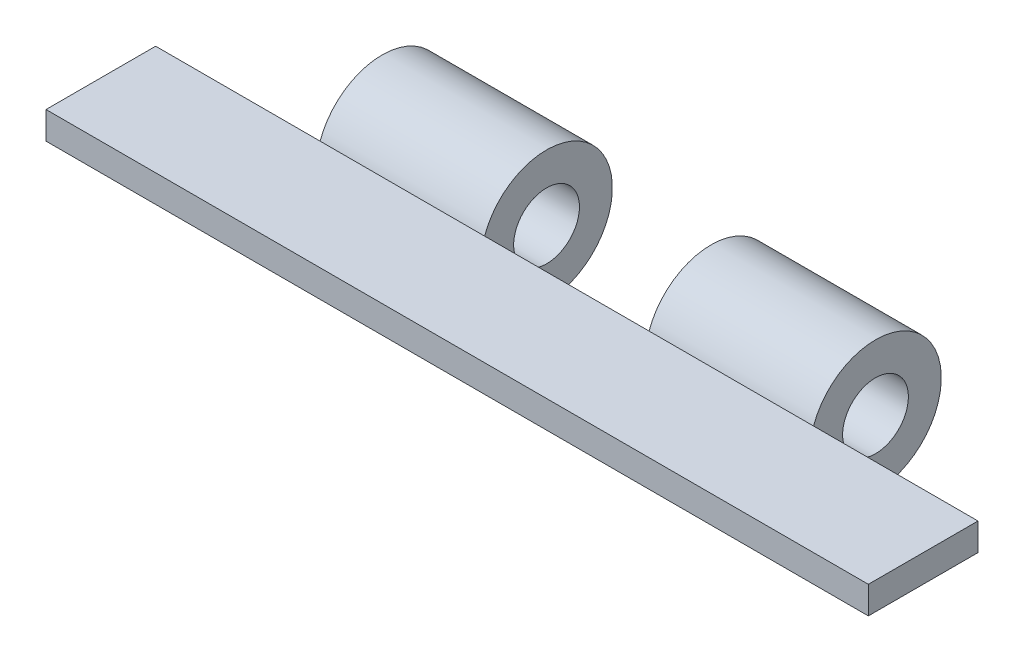
ISO-10303-21;
HEADER;
FILE_DESCRIPTION(('STEP AP214'),'2;1');
FILE_NAME('part.step','',(''),(''),'','','');
FILE_SCHEMA(('AUTOMOTIVE_DESIGN { 1 0 10303 214 1 1 1 1 }'));
ENDSEC;
DATA;
#1=APPLICATION_CONTEXT('core data for automotive mechanical design processes');
#2=APPLICATION_PROTOCOL_DEFINITION('international standard','automotive_design',2000,#1);
#3=PRODUCT_CONTEXT('',#1,'mechanical');
#4=PRODUCT('Part','Part','',(#3));
#5=PRODUCT_RELATED_PRODUCT_CATEGORY('part','',(#4));
#6=PRODUCT_DEFINITION_FORMATION('','',#4);
#7=PRODUCT_DEFINITION_CONTEXT('part definition',#1,'design');
#8=PRODUCT_DEFINITION('design','',#6,#7);
#9=PRODUCT_DEFINITION_SHAPE('','',#8);
#10=(LENGTH_UNIT() NAMED_UNIT(*) SI_UNIT(.MILLI.,.METRE.));
#11=(NAMED_UNIT(*) PLANE_ANGLE_UNIT() SI_UNIT($,.RADIAN.));
#12=(NAMED_UNIT(*) SI_UNIT($,.STERADIAN.) SOLID_ANGLE_UNIT());
#13=UNCERTAINTY_MEASURE_WITH_UNIT(LENGTH_MEASURE(1.E-05),#10,'distance_accuracy_value','');
#14=(GEOMETRIC_REPRESENTATION_CONTEXT(3) GLOBAL_UNCERTAINTY_ASSIGNED_CONTEXT((#13)) GLOBAL_UNIT_ASSIGNED_CONTEXT((#10,
#11,#12)) REPRESENTATION_CONTEXT('',''));
#15=CARTESIAN_POINT('',(0.,0.,0.));
#16=DIRECTION('',(0.,0.,1.));
#17=DIRECTION('',(1.,0.,0.));
#18=AXIS2_PLACEMENT_3D('',#15,#16,#17);
#19=CARTESIAN_POINT('',(75.,5.,-10.));
#20=DIRECTION('',(0.,0.,1.));
#21=DIRECTION('',(1.,0.,0.));
#22=AXIS2_PLACEMENT_3D('',#19,#20,#21);
#23=PLANE('',#22);
#24=DIRECTION('',(0.,1.,0.));
#25=VECTOR('',#24,1.);
#26=CARTESIAN_POINT('',(-45.,5.,-9.99999999999999));
#27=LINE('',#26,#25);
#28=CARTESIAN_POINT('',(-45.,0.,-10.));
#29=VERTEX_POINT('',#28);
#30=CARTESIAN_POINT('',(-45.,5.,-9.99999999999999));
#31=VERTEX_POINT('',#30);
#32=EDGE_CURVE('E221',#29,#31,#27,.T.);
#33=ORIENTED_EDGE('',*,*,#32,.F.);
#34=DIRECTION('',(-1.,0.,0.));
#35=VECTOR('',#34,1.);
#36=CARTESIAN_POINT('',(75.,0.,-10.));
#37=LINE('',#36,#35);
#38=CARTESIAN_POINT('',(-75.,0.,-9.99999999999999));
#39=VERTEX_POINT('',#38);
#40=EDGE_CURVE('E155',#29,#39,#37,.T.);
#41=ORIENTED_EDGE('',*,*,#40,.T.);
#42=DIRECTION('',(0.,-1.,0.));
#43=VECTOR('',#42,1.);
#44=CARTESIAN_POINT('',(-75.,5.,-9.99999999999999));
#45=LINE('',#44,#43);
#46=CARTESIAN_POINT('',(-75.,5.,-9.99999999999999));
#47=VERTEX_POINT('',#46);
#48=EDGE_CURVE('E143',#47,#39,#45,.T.);
#49=ORIENTED_EDGE('',*,*,#48,.F.);
#50=DIRECTION('',(-1.,0.,0.));
#51=VECTOR('',#50,1.);
#52=CARTESIAN_POINT('',(75.,5.,-10.));
#53=LINE('',#52,#51);
#54=EDGE_CURVE('E118',#31,#47,#53,.T.);
#55=ORIENTED_EDGE('',*,*,#54,.F.);
#56=EDGE_LOOP('',(#33,#41,#49,#55));
#57=FACE_BOUND('',#56,.T.);
#58=ADVANCED_FACE('F34',(#57),#23,.F.);
#59=CARTESIAN_POINT('',(0.,0.,0.));
#60=DIRECTION('',(0.,1.,0.));
#61=DIRECTION('',(0.,0.,1.));
#62=AXIS2_PLACEMENT_3D('',#59,#60,#61);
#63=PLANE('',#62);
#64=DIRECTION('',(0.,0.,-1.));
#65=VECTOR('',#64,1.);
#66=CARTESIAN_POINT('',(-45.,0.,0.));
#67=LINE('',#66,#65);
#68=CARTESIAN_POINT('',(-45.,0.,-9.34299701688208));
#69=VERTEX_POINT('',#68);
#70=EDGE_CURVE('E136',#69,#29,#67,.T.);
#71=ORIENTED_EDGE('',*,*,#70,.F.);
#72=DIRECTION('',(1.,0.,0.));
#73=VECTOR('',#72,1.);
#74=CARTESIAN_POINT('',(-45.,0.,-9.34299701688208));
#75=LINE('',#74,#73);
#76=CARTESIAN_POINT('',(-15.,0.,-9.34299701688208));
#77=VERTEX_POINT('',#76);
#78=EDGE_CURVE('E219',#69,#77,#75,.T.);
#79=ORIENTED_EDGE('',*,*,#78,.T.);
#80=DIRECTION('',(0.,0.,-1.));
#81=VECTOR('',#80,1.);
#82=CARTESIAN_POINT('',(-15.,0.,0.));
#83=LINE('',#82,#81);
#84=CARTESIAN_POINT('',(-15.,0.,-10.));
#85=VERTEX_POINT('',#84);
#86=EDGE_CURVE('E125',#77,#85,#83,.T.);
#87=ORIENTED_EDGE('',*,*,#86,.T.);
#88=CARTESIAN_POINT('',(15.,0.,-10.));
#89=VERTEX_POINT('',#88);
#90=EDGE_CURVE('E135',#89,#85,#37,.T.);
#91=ORIENTED_EDGE('',*,*,#90,.F.);
#92=DIRECTION('',(0.,0.,-1.));
#93=VECTOR('',#92,1.);
#94=CARTESIAN_POINT('',(15.,0.,0.));
#95=LINE('',#94,#93);
#96=CARTESIAN_POINT('',(15.,0.,-9.34299701688208));
#97=VERTEX_POINT('',#96);
#98=EDGE_CURVE('E11',#97,#89,#95,.T.);
#99=ORIENTED_EDGE('',*,*,#98,.F.);
#100=DIRECTION('',(1.,0.,0.));
#101=VECTOR('',#100,1.);
#102=CARTESIAN_POINT('',(15.,0.,-9.34299701688208));
#103=LINE('',#102,#101);
#104=CARTESIAN_POINT('',(45.,0.,-9.34299701688208));
#105=VERTEX_POINT('',#104);
#106=EDGE_CURVE('E42',#97,#105,#103,.T.);
#107=ORIENTED_EDGE('',*,*,#106,.T.);
#108=DIRECTION('',(0.,0.,-1.));
#109=VECTOR('',#108,1.);
#110=CARTESIAN_POINT('',(45.,0.,0.));
#111=LINE('',#110,#109);
#112=CARTESIAN_POINT('',(45.,0.,-10.));
#113=VERTEX_POINT('',#112);
#114=EDGE_CURVE('E171',#105,#113,#111,.T.);
#115=ORIENTED_EDGE('',*,*,#114,.T.);
#116=CARTESIAN_POINT('',(75.,0.,-10.));
#117=VERTEX_POINT('',#116);
#118=EDGE_CURVE('E156',#117,#113,#37,.T.);
#119=ORIENTED_EDGE('',*,*,#118,.F.);
#120=DIRECTION('',(0.,0.,-1.));
#121=VECTOR('',#120,1.);
#122=CARTESIAN_POINT('',(75.,0.,9.99999999999999));
#123=LINE('',#122,#121);
#124=CARTESIAN_POINT('',(75.,0.,9.99999999999999));
#125=VERTEX_POINT('',#124);
#126=EDGE_CURVE('E153',#125,#117,#123,.T.);
#127=ORIENTED_EDGE('',*,*,#126,.F.);
#128=DIRECTION('',(1.,0.,0.));
#129=VECTOR('',#128,1.);
#130=CARTESIAN_POINT('',(75.,0.,9.99999999999999));
#131=LINE('',#130,#129);
#132=CARTESIAN_POINT('',(-75.,0.,10.));
#133=VERTEX_POINT('',#132);
#134=EDGE_CURVE('E151',#133,#125,#131,.T.);
#135=ORIENTED_EDGE('',*,*,#134,.F.);
#136=DIRECTION('',(0.,0.,1.));
#137=VECTOR('',#136,1.);
#138=CARTESIAN_POINT('',(-75.,0.,10.));
#139=LINE('',#138,#137);
#140=EDGE_CURVE('E148',#39,#133,#139,.T.);
#141=ORIENTED_EDGE('',*,*,#140,.F.);
#142=ORIENTED_EDGE('',*,*,#40,.F.);
#143=EDGE_LOOP('',(#71,#79,#87,#91,#99,#107,#115,#119,#127,#135,#141,#142));
#144=FACE_BOUND('',#143,.T.);
#145=ADVANCED_FACE('F176',(#144),#63,.F.);
#146=ORIENTED_EDGE('',*,*,#90,.T.);
#147=DIRECTION('',(0.,1.,0.));
#148=VECTOR('',#147,1.);
#149=CARTESIAN_POINT('',(-15.,5.,-10.));
#150=LINE('',#149,#148);
#151=CARTESIAN_POINT('',(-15.,5.,-10.));
#152=VERTEX_POINT('',#151);
#153=EDGE_CURVE('E123',#85,#152,#150,.T.);
#154=ORIENTED_EDGE('',*,*,#153,.T.);
#155=CARTESIAN_POINT('',(15.,5.,-10.));
#156=VERTEX_POINT('',#155);
#157=EDGE_CURVE('E117',#156,#152,#53,.T.);
#158=ORIENTED_EDGE('',*,*,#157,.F.);
#159=DIRECTION('',(0.,1.,0.));
#160=VECTOR('',#159,1.);
#161=CARTESIAN_POINT('',(15.,5.,-10.));
#162=LINE('',#161,#160);
#163=EDGE_CURVE('E187',#89,#156,#162,.T.);
#164=ORIENTED_EDGE('',*,*,#163,.F.);
#165=EDGE_LOOP('',(#146,#154,#158,#164));
#166=FACE_BOUND('',#165,.T.);
#167=ADVANCED_FACE('F131',(#166),#23,.F.);
#168=CARTESIAN_POINT('',(-75.,5.,10.));
#169=DIRECTION('',(1.,0.,0.));
#170=DIRECTION('',(0.,0.,-1.));
#171=AXIS2_PLACEMENT_3D('',#168,#169,#170);
#172=PLANE('',#171);
#173=ORIENTED_EDGE('',*,*,#140,.T.);
#174=DIRECTION('',(0.,-1.,0.));
#175=VECTOR('',#174,1.);
#176=CARTESIAN_POINT('',(-75.,5.,10.));
#177=LINE('',#176,#175);
#178=CARTESIAN_POINT('',(-75.,5.,10.));
#179=VERTEX_POINT('',#178);
#180=EDGE_CURVE('E168',#179,#133,#177,.T.);
#181=ORIENTED_EDGE('',*,*,#180,.F.);
#182=DIRECTION('',(0.,0.,1.));
#183=VECTOR('',#182,1.);
#184=CARTESIAN_POINT('',(-75.,5.,10.));
#185=LINE('',#184,#183);
#186=EDGE_CURVE('E159',#47,#179,#185,.T.);
#187=ORIENTED_EDGE('',*,*,#186,.F.);
#188=ORIENTED_EDGE('',*,*,#48,.T.);
#189=EDGE_LOOP('',(#173,#181,#187,#188));
#190=FACE_BOUND('',#189,.T.);
#191=ADVANCED_FACE('F36',(#190),#172,.F.);
#192=CARTESIAN_POINT('',(75.,5.,9.99999999999999));
#193=DIRECTION('',(0.,0.,-1.));
#194=DIRECTION('',(-1.,0.,0.));
#195=AXIS2_PLACEMENT_3D('',#192,#193,#194);
#196=PLANE('',#195);
#197=ORIENTED_EDGE('',*,*,#134,.T.);
#198=DIRECTION('',(0.,-1.,0.));
#199=VECTOR('',#198,1.);
#200=CARTESIAN_POINT('',(75.,5.,9.99999999999999));
#201=LINE('',#200,#199);
#202=CARTESIAN_POINT('',(75.,5.,9.99999999999999));
#203=VERTEX_POINT('',#202);
#204=EDGE_CURVE('E165',#203,#125,#201,.T.);
#205=ORIENTED_EDGE('',*,*,#204,.F.);
#206=DIRECTION('',(1.,0.,0.));
#207=VECTOR('',#206,1.);
#208=CARTESIAN_POINT('',(75.,5.,9.99999999999999));
#209=LINE('',#208,#207);
#210=EDGE_CURVE('E198',#179,#203,#209,.T.);
#211=ORIENTED_EDGE('',*,*,#210,.F.);
#212=ORIENTED_EDGE('',*,*,#180,.T.);
#213=EDGE_LOOP('',(#197,#205,#211,#212));
#214=FACE_BOUND('',#213,.T.);
#215=ADVANCED_FACE('F212',(#214),#196,.F.);
#216=CARTESIAN_POINT('',(75.,5.,9.99999999999999));
#217=DIRECTION('',(-1.,0.,0.));
#218=DIRECTION('',(0.,0.,1.));
#219=AXIS2_PLACEMENT_3D('',#216,#217,#218);
#220=PLANE('',#219);
#221=ORIENTED_EDGE('',*,*,#126,.T.);
#222=DIRECTION('',(0.,-1.,0.));
#223=VECTOR('',#222,1.);
#224=CARTESIAN_POINT('',(75.,5.,-10.));
#225=LINE('',#224,#223);
#226=CARTESIAN_POINT('',(75.,5.,-10.));
#227=VERTEX_POINT('',#226);
#228=EDGE_CURVE('E162',#227,#117,#225,.T.);
#229=ORIENTED_EDGE('',*,*,#228,.F.);
#230=DIRECTION('',(0.,0.,-1.));
#231=VECTOR('',#230,1.);
#232=CARTESIAN_POINT('',(75.,5.,9.99999999999999));
#233=LINE('',#232,#231);
#234=EDGE_CURVE('E146',#203,#227,#233,.T.);
#235=ORIENTED_EDGE('',*,*,#234,.F.);
#236=ORIENTED_EDGE('',*,*,#204,.T.);
#237=EDGE_LOOP('',(#221,#229,#235,#236));
#238=FACE_BOUND('',#237,.T.);
#239=ADVANCED_FACE('F215',(#238),#220,.F.);
#240=ORIENTED_EDGE('',*,*,#118,.T.);
#241=DIRECTION('',(0.,1.,0.));
#242=VECTOR('',#241,1.);
#243=CARTESIAN_POINT('',(45.,5.,-10.));
#244=LINE('',#243,#242);
#245=CARTESIAN_POINT('',(45.,5.,-10.));
#246=VERTEX_POINT('',#245);
#247=EDGE_CURVE('E57',#113,#246,#244,.T.);
#248=ORIENTED_EDGE('',*,*,#247,.T.);
#249=EDGE_CURVE('E142',#227,#246,#53,.T.);
#250=ORIENTED_EDGE('',*,*,#249,.F.);
#251=ORIENTED_EDGE('',*,*,#228,.T.);
#252=EDGE_LOOP('',(#240,#248,#250,#251));
#253=FACE_BOUND('',#252,.T.);
#254=ADVANCED_FACE('F218',(#253),#23,.F.);
#255=CARTESIAN_POINT('',(0.,5.,0.));
#256=DIRECTION('',(0.,1.,0.));
#257=DIRECTION('',(0.,0.,1.));
#258=AXIS2_PLACEMENT_3D('',#255,#256,#257);
#259=PLANE('',#258);
#260=ORIENTED_EDGE('',*,*,#186,.T.);
#261=ORIENTED_EDGE('',*,*,#210,.T.);
#262=ORIENTED_EDGE('',*,*,#234,.T.);
#263=ORIENTED_EDGE('',*,*,#249,.T.);
#264=DIRECTION('',(1.,0.,0.));
#265=VECTOR('',#264,1.);
#266=CARTESIAN_POINT('',(15.,5.,-10.));
#267=LINE('',#266,#265);
#268=EDGE_CURVE('E141',#156,#246,#267,.T.);
#269=ORIENTED_EDGE('',*,*,#268,.F.);
#270=ORIENTED_EDGE('',*,*,#157,.T.);
#271=EDGE_CURVE('E110',#152,#31,#53,.T.);
#272=ORIENTED_EDGE('',*,*,#271,.T.);
#273=ORIENTED_EDGE('',*,*,#54,.T.);
#274=EDGE_LOOP('',(#260,#261,#262,#263,#269,#270,#272,#273));
#275=FACE_BOUND('',#274,.T.);
#276=ADVANCED_FACE('F139',(#275),#259,.T.);
#277=CARTESIAN_POINT('',(15.,0.971534390047333,-21.3036040637236));
#278=DIRECTION('',(1.,0.,0.));
#279=DIRECTION('',(0.,0.,-1.));
#280=AXIS2_PLACEMENT_3D('',#277,#278,#279);
#281=PLANE('',#280);
#282=CARTESIAN_POINT('',(15.,0.971534390047333,-21.3036040637236));
#283=DIRECTION('',(1.,0.,0.));
#284=DIRECTION('',(0.,0.,-1.));
#285=AXIS2_PLACEMENT_3D('',#282,#283,#284);
#286=CIRCLE('',#285,6.);
#287=CARTESIAN_POINT('',(15.,0.971534390047333,-27.3036040637236));
#288=VERTEX_POINT('',#287);
#289=EDGE_CURVE('E190',#288,#288,#286,.T.);
#290=ORIENTED_EDGE('',*,*,#289,.T.);
#291=EDGE_LOOP('',(#290));
#292=FACE_BOUND('',#291,.T.);
#293=ORIENTED_EDGE('',*,*,#98,.T.);
#294=ORIENTED_EDGE('',*,*,#163,.T.);
#295=CARTESIAN_POINT('',(15.,0.971534390047333,-21.3036040637236));
#296=DIRECTION('',(1.,0.,0.));
#297=DIRECTION('',(0.,0.,-1.));
#298=AXIS2_PLACEMENT_3D('',#295,#296,#297);
#299=CIRCLE('',#298,12.);
#300=EDGE_CURVE('E183',#97,#156,#299,.T.);
#301=ORIENTED_EDGE('',*,*,#300,.F.);
#302=EDGE_LOOP('',(#293,#294,#301));
#303=FACE_BOUND('',#302,.T.);
#304=ADVANCED_FACE('F186',(#292,#303),#281,.F.);
#305=CARTESIAN_POINT('',(45.,0.971534390047333,-21.3036040637236));
#306=DIRECTION('',(1.,0.,0.));
#307=DIRECTION('',(0.,0.,-1.));
#308=AXIS2_PLACEMENT_3D('',#305,#306,#307);
#309=PLANE('',#308);
#310=CARTESIAN_POINT('',(45.,0.971534390047333,-21.3036040637236));
#311=DIRECTION('',(1.,0.,0.));
#312=DIRECTION('',(0.,0.,-1.));
#313=AXIS2_PLACEMENT_3D('',#310,#311,#312);
#314=CIRCLE('',#313,6.);
#315=CARTESIAN_POINT('',(45.,0.971534390047333,-27.3036040637236));
#316=VERTEX_POINT('',#315);
#317=EDGE_CURVE('E193',#316,#316,#314,.T.);
#318=ORIENTED_EDGE('',*,*,#317,.F.);
#319=EDGE_LOOP('',(#318));
#320=FACE_BOUND('',#319,.T.);
#321=ORIENTED_EDGE('',*,*,#247,.F.);
#322=ORIENTED_EDGE('',*,*,#114,.F.);
#323=CARTESIAN_POINT('',(45.,0.971534390047333,-21.3036040637236));
#324=DIRECTION('',(1.,0.,0.));
#325=DIRECTION('',(0.,0.,-1.));
#326=AXIS2_PLACEMENT_3D('',#323,#324,#325);
#327=CIRCLE('',#326,12.);
#328=EDGE_CURVE('E184',#105,#246,#327,.T.);
#329=ORIENTED_EDGE('',*,*,#328,.T.);
#330=EDGE_LOOP('',(#321,#322,#329));
#331=FACE_BOUND('',#330,.T.);
#332=ADVANCED_FACE('F234',(#320,#331),#309,.T.);
#333=CARTESIAN_POINT('',(15.,0.971534390047333,-21.3036040637236));
#334=DIRECTION('',(1.,0.,0.));
#335=DIRECTION('',(0.,0.,-1.));
#336=AXIS2_PLACEMENT_3D('',#333,#334,#335);
#337=CYLINDRICAL_SURFACE('',#336,12.);
#338=ORIENTED_EDGE('',*,*,#300,.T.);
#339=ORIENTED_EDGE('',*,*,#268,.T.);
#340=ORIENTED_EDGE('',*,*,#328,.F.);
#341=ORIENTED_EDGE('',*,*,#106,.F.);
#342=EDGE_LOOP('',(#338,#339,#340,#341));
#343=FACE_BOUND('',#342,.T.);
#344=ADVANCED_FACE('F182',(#343),#337,.T.);
#345=CARTESIAN_POINT('',(15.,0.971534390047333,-21.3036040637236));
#346=DIRECTION('',(1.,0.,0.));
#347=DIRECTION('',(0.,0.,-1.));
#348=AXIS2_PLACEMENT_3D('',#345,#346,#347);
#349=CYLINDRICAL_SURFACE('',#348,6.);
#350=ORIENTED_EDGE('',*,*,#289,.F.);
#351=EDGE_LOOP('',(#350));
#352=FACE_BOUND('',#351,.T.);
#353=ORIENTED_EDGE('',*,*,#317,.T.);
#354=EDGE_LOOP('',(#353));
#355=FACE_BOUND('',#354,.T.);
#356=ADVANCED_FACE('F232',(#352,#355),#349,.F.);
#357=CARTESIAN_POINT('',(-45.,0.971534390047333,-21.3036040637236));
#358=DIRECTION('',(1.,0.,0.));
#359=DIRECTION('',(0.,0.,-1.));
#360=AXIS2_PLACEMENT_3D('',#357,#358,#359);
#361=CYLINDRICAL_SURFACE('',#360,12.);
#362=ORIENTED_EDGE('',*,*,#78,.F.);
#363=CARTESIAN_POINT('',(-45.,0.971534390047333,-21.3036040637236));
#364=DIRECTION('',(1.,0.,0.));
#365=DIRECTION('',(0.,0.,-1.));
#366=AXIS2_PLACEMENT_3D('',#363,#364,#365);
#367=CIRCLE('',#366,12.);
#368=EDGE_CURVE('E49',#69,#31,#367,.T.);
#369=ORIENTED_EDGE('',*,*,#368,.T.);
#370=ORIENTED_EDGE('',*,*,#271,.F.);
#371=CARTESIAN_POINT('',(-15.,0.971534390047333,-21.3036040637236));
#372=DIRECTION('',(1.,0.,0.));
#373=DIRECTION('',(0.,0.,-1.));
#374=AXIS2_PLACEMENT_3D('',#371,#372,#373);
#375=CIRCLE('',#374,12.);
#376=EDGE_CURVE('E113',#77,#152,#375,.T.);
#377=ORIENTED_EDGE('',*,*,#376,.F.);
#378=EDGE_LOOP('',(#362,#369,#370,#377));
#379=FACE_BOUND('',#378,.T.);
#380=ADVANCED_FACE('F112',(#379),#361,.T.);
#381=CARTESIAN_POINT('',(-45.,0.971534390047333,-21.3036040637236));
#382=DIRECTION('',(1.,0.,0.));
#383=DIRECTION('',(0.,0.,-1.));
#384=AXIS2_PLACEMENT_3D('',#381,#382,#383);
#385=PLANE('',#384);
#386=CARTESIAN_POINT('',(-45.,0.971534390047333,-21.3036040637236));
#387=DIRECTION('',(1.,0.,0.));
#388=DIRECTION('',(0.,0.,-1.));
#389=AXIS2_PLACEMENT_3D('',#386,#387,#388);
#390=CIRCLE('',#389,6.);
#391=CARTESIAN_POINT('',(-45.,0.971534390047333,-27.3036040637236));
#392=VERTEX_POINT('',#391);
#393=EDGE_CURVE('E126',#392,#392,#390,.T.);
#394=ORIENTED_EDGE('',*,*,#393,.T.);
#395=EDGE_LOOP('',(#394));
#396=FACE_BOUND('',#395,.T.);
#397=ORIENTED_EDGE('',*,*,#70,.T.);
#398=ORIENTED_EDGE('',*,*,#32,.T.);
#399=ORIENTED_EDGE('',*,*,#368,.F.);
#400=EDGE_LOOP('',(#397,#398,#399));
#401=FACE_BOUND('',#400,.T.);
#402=ADVANCED_FACE('F333',(#396,#401),#385,.F.);
#403=CARTESIAN_POINT('',(-15.,0.971534390047333,-21.3036040637236));
#404=DIRECTION('',(1.,0.,0.));
#405=DIRECTION('',(0.,0.,-1.));
#406=AXIS2_PLACEMENT_3D('',#403,#404,#405);
#407=PLANE('',#406);
#408=CARTESIAN_POINT('',(-15.,0.971534390047333,-21.3036040637236));
#409=DIRECTION('',(1.,0.,0.));
#410=DIRECTION('',(0.,0.,-1.));
#411=AXIS2_PLACEMENT_3D('',#408,#409,#410);
#412=CIRCLE('',#411,6.);
#413=CARTESIAN_POINT('',(-15.,0.971534390047333,-27.3036040637236));
#414=VERTEX_POINT('',#413);
#415=EDGE_CURVE('E370',#414,#414,#412,.T.);
#416=ORIENTED_EDGE('',*,*,#415,.F.);
#417=EDGE_LOOP('',(#416));
#418=FACE_BOUND('',#417,.T.);
#419=ORIENTED_EDGE('',*,*,#153,.F.);
#420=ORIENTED_EDGE('',*,*,#86,.F.);
#421=ORIENTED_EDGE('',*,*,#376,.T.);
#422=EDGE_LOOP('',(#419,#420,#421));
#423=FACE_BOUND('',#422,.T.);
#424=ADVANCED_FACE('F122',(#418,#423),#407,.T.);
#425=CARTESIAN_POINT('',(-45.,0.971534390047333,-21.3036040637236));
#426=DIRECTION('',(1.,0.,0.));
#427=DIRECTION('',(0.,0.,-1.));
#428=AXIS2_PLACEMENT_3D('',#425,#426,#427);
#429=CYLINDRICAL_SURFACE('',#428,6.);
#430=ORIENTED_EDGE('',*,*,#393,.F.);
#431=EDGE_LOOP('',(#430));
#432=FACE_BOUND('',#431,.T.);
#433=ORIENTED_EDGE('',*,*,#415,.T.);
#434=EDGE_LOOP('',(#433));
#435=FACE_BOUND('',#434,.T.);
#436=ADVANCED_FACE('F351',(#432,#435),#429,.F.);
#437=CLOSED_SHELL('',(#58,#145,#167,#191,#215,#239,#254,#276,#304,#332,#344,#356,#380,#402,#424,#436));
#438=MANIFOLD_SOLID_BREP('B2',#437);
#439=ADVANCED_BREP_SHAPE_REPRESENTATION('',(#18,#438),#14);
#440=SHAPE_DEFINITION_REPRESENTATION(#9,#439);
ENDSEC;
END-ISO-10303-21;
